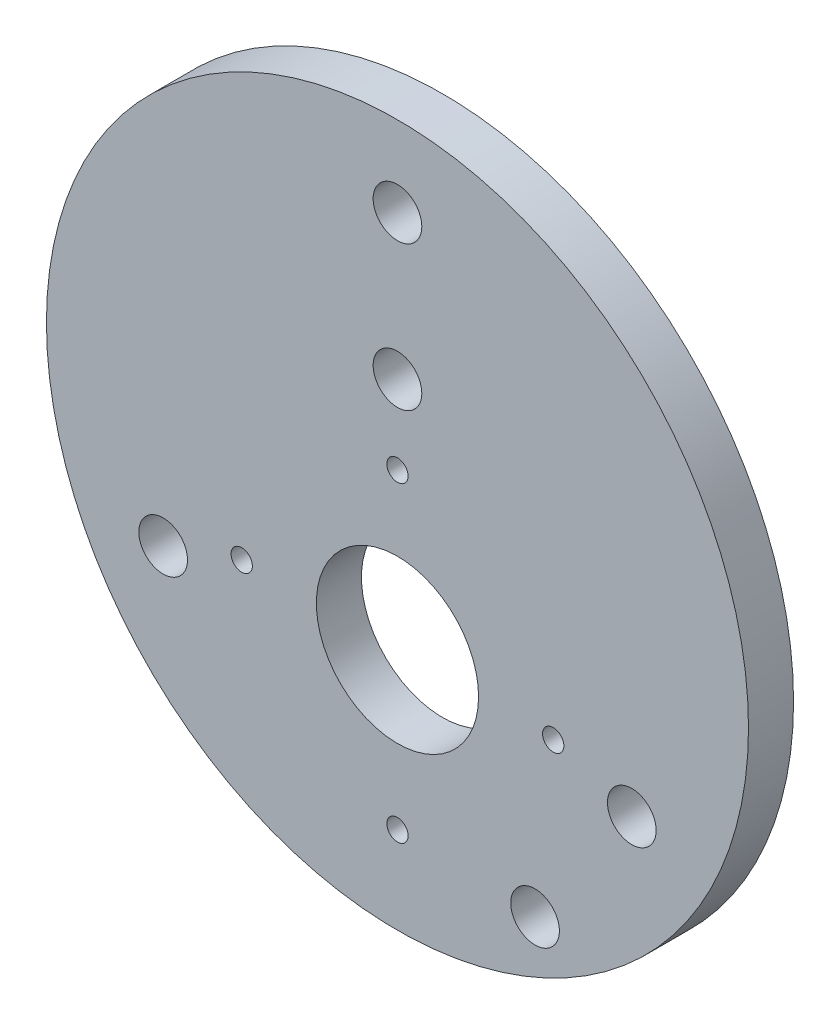
ISO-10303-21;
HEADER;
FILE_DESCRIPTION(('STEP AP214'),'2;1');
FILE_NAME('part.step','',(''),(''),'','','');
FILE_SCHEMA(('AUTOMOTIVE_DESIGN { 1 0 10303 214 1 1 1 1 }'));
ENDSEC;
DATA;
#1=APPLICATION_CONTEXT('core data for automotive mechanical design processes');
#2=APPLICATION_PROTOCOL_DEFINITION('international standard','automotive_design',2000,#1);
#3=PRODUCT_CONTEXT('',#1,'mechanical');
#4=PRODUCT('Part','Part','',(#3));
#5=PRODUCT_RELATED_PRODUCT_CATEGORY('part','',(#4));
#6=PRODUCT_DEFINITION_FORMATION('','',#4);
#7=PRODUCT_DEFINITION_CONTEXT('part definition',#1,'design');
#8=PRODUCT_DEFINITION('design','',#6,#7);
#9=PRODUCT_DEFINITION_SHAPE('','',#8);
#10=(LENGTH_UNIT() NAMED_UNIT(*) SI_UNIT(.MILLI.,.METRE.));
#11=(NAMED_UNIT(*) PLANE_ANGLE_UNIT() SI_UNIT($,.RADIAN.));
#12=(NAMED_UNIT(*) SI_UNIT($,.STERADIAN.) SOLID_ANGLE_UNIT());
#13=UNCERTAINTY_MEASURE_WITH_UNIT(LENGTH_MEASURE(1.E-05),#10,'distance_accuracy_value','');
#14=(GEOMETRIC_REPRESENTATION_CONTEXT(3) GLOBAL_UNCERTAINTY_ASSIGNED_CONTEXT((#13)) GLOBAL_UNIT_ASSIGNED_CONTEXT((#10,
#11,#12)) REPRESENTATION_CONTEXT('',''));
#15=CARTESIAN_POINT('',(0.,0.,0.));
#16=DIRECTION('',(0.,0.,1.));
#17=DIRECTION('',(1.,0.,0.));
#18=AXIS2_PLACEMENT_3D('',#15,#16,#17);
#19=CARTESIAN_POINT('',(0.,0.,6.35));
#20=DIRECTION('',(0.,0.,-1.));
#21=DIRECTION('',(-1.,0.,0.));
#22=AXIS2_PLACEMENT_3D('',#19,#20,#21);
#23=CYLINDRICAL_SURFACE('',#22,49.4665);
#24=CARTESIAN_POINT('',(0.,0.,6.35));
#25=DIRECTION('',(0.,0.,1.));
#26=DIRECTION('',(1.,0.,0.));
#27=AXIS2_PLACEMENT_3D('',#24,#25,#26);
#28=CIRCLE('',#27,49.4665);
#29=CARTESIAN_POINT('',(49.4665,0.,6.35));
#30=VERTEX_POINT('',#29);
#31=EDGE_CURVE('E10',#30,#30,#28,.T.);
#32=ORIENTED_EDGE('',*,*,#31,.F.);
#33=EDGE_LOOP('',(#32));
#34=FACE_BOUND('',#33,.T.);
#35=CARTESIAN_POINT('',(0.,0.,0.));
#36=DIRECTION('',(0.,0.,1.));
#37=DIRECTION('',(1.,0.,0.));
#38=AXIS2_PLACEMENT_3D('',#35,#36,#37);
#39=CIRCLE('',#38,49.4665);
#40=CARTESIAN_POINT('',(49.4665,0.,0.));
#41=VERTEX_POINT('',#40);
#42=EDGE_CURVE('E41',#41,#41,#39,.T.);
#43=ORIENTED_EDGE('',*,*,#42,.T.);
#44=EDGE_LOOP('',(#43));
#45=FACE_BOUND('',#44,.T.);
#46=ADVANCED_FACE('F38',(#34,#45),#23,.T.);
#47=CARTESIAN_POINT('',(0.,0.,6.35));
#48=DIRECTION('',(0.,0.,1.));
#49=DIRECTION('',(1.,0.,0.));
#50=AXIS2_PLACEMENT_3D('',#47,#48,#49);
#51=PLANE('',#50);
#52=CARTESIAN_POINT('',(19.3897127595552,-38.1355449146473,6.35));
#53=DIRECTION('',(0.,0.,1.));
#54=DIRECTION('',(1.,0.,0.));
#55=AXIS2_PLACEMENT_3D('',#52,#53,#54);
#56=CIRCLE('',#55,3.429);
#57=CARTESIAN_POINT('',(22.8187127595552,-38.1355449146473,6.35));
#58=VERTEX_POINT('',#57);
#59=EDGE_CURVE('E124',#58,#58,#56,.T.);
#60=ORIENTED_EDGE('',*,*,#59,.F.);
#61=EDGE_LOOP('',(#60));
#62=FACE_BOUND('',#61,.T.);
#63=CARTESIAN_POINT('',(0.,17.78,6.35));
#64=DIRECTION('',(0.,0.,1.));
#65=DIRECTION('',(1.,0.,0.));
#66=AXIS2_PLACEMENT_3D('',#63,#64,#65);
#67=CIRCLE('',#66,3.429);
#68=CARTESIAN_POINT('',(3.429,17.78,6.35));
#69=VERTEX_POINT('',#68);
#70=EDGE_CURVE('E116',#69,#69,#67,.T.);
#71=ORIENTED_EDGE('',*,*,#70,.F.);
#72=EDGE_LOOP('',(#71));
#73=FACE_BOUND('',#72,.T.);
#74=CARTESIAN_POINT('',(0.,-15.24,6.35));
#75=DIRECTION('',(0.,0.,1.));
#76=DIRECTION('',(1.,0.,0.));
#77=AXIS2_PLACEMENT_3D('',#74,#75,#76);
#78=CIRCLE('',#77,11.43);
#79=CARTESIAN_POINT('',(11.43,-15.24,6.35));
#80=VERTEX_POINT('',#79);
#81=EDGE_CURVE('E108',#80,#80,#78,.T.);
#82=ORIENTED_EDGE('',*,*,#81,.F.);
#83=EDGE_LOOP('',(#82));
#84=FACE_BOUND('',#83,.T.);
#85=CARTESIAN_POINT('',(0.,38.128211777283,6.35));
#86=DIRECTION('',(0.,0.,1.));
#87=DIRECTION('',(1.,0.,0.));
#88=AXIS2_PLACEMENT_3D('',#85,#86,#87);
#89=CIRCLE('',#88,3.429);
#90=CARTESIAN_POINT('',(3.429,38.128211777283,6.35));
#91=VERTEX_POINT('',#90);
#92=EDGE_CURVE('E101',#91,#91,#89,.T.);
#93=ORIENTED_EDGE('',*,*,#92,.F.);
#94=EDGE_LOOP('',(#93));
#95=FACE_BOUND('',#94,.T.);
#96=CARTESIAN_POINT('',(-33.0200000000003,-19.0641058886412,6.35));
#97=DIRECTION('',(0.,0.,1.));
#98=DIRECTION('',(1.,0.,0.));
#99=AXIS2_PLACEMENT_3D('',#96,#97,#98);
#100=CIRCLE('',#99,3.429);
#101=CARTESIAN_POINT('',(-29.5910000000003,-19.0641058886412,6.35));
#102=VERTEX_POINT('',#101);
#103=EDGE_CURVE('E93',#102,#102,#100,.T.);
#104=ORIENTED_EDGE('',*,*,#103,.F.);
#105=EDGE_LOOP('',(#104));
#106=FACE_BOUND('',#105,.T.);
#107=CARTESIAN_POINT('',(33.0200000000003,-19.0641058886412,6.35));
#108=DIRECTION('',(0.,0.,1.));
#109=DIRECTION('',(1.,0.,0.));
#110=AXIS2_PLACEMENT_3D('',#107,#108,#109);
#111=CIRCLE('',#110,3.429);
#112=CARTESIAN_POINT('',(36.4490000000003,-19.0641058886412,6.35));
#113=VERTEX_POINT('',#112);
#114=EDGE_CURVE('E84',#113,#113,#111,.T.);
#115=ORIENTED_EDGE('',*,*,#114,.F.);
#116=EDGE_LOOP('',(#115));
#117=FACE_BOUND('',#116,.T.);
#118=CARTESIAN_POINT('',(0.,6.70774595989301,6.35));
#119=DIRECTION('',(0.,0.,1.));
#120=DIRECTION('',(1.,0.,0.));
#121=AXIS2_PLACEMENT_3D('',#118,#119,#120);
#122=CIRCLE('',#121,1.5);
#123=CARTESIAN_POINT('',(1.49999999999991,6.70774595989301,6.35));
#124=VERTEX_POINT('',#123);
#125=EDGE_CURVE('E79',#124,#124,#122,.T.);
#126=ORIENTED_EDGE('',*,*,#125,.F.);
#127=EDGE_LOOP('',(#126));
#128=FACE_BOUND('',#127,.T.);
#129=CARTESIAN_POINT('',(-21.947745959893,-15.2400000000001,6.35));
#130=DIRECTION('',(0.,0.,1.));
#131=DIRECTION('',(1.,0.,0.));
#132=AXIS2_PLACEMENT_3D('',#129,#130,#131);
#133=CIRCLE('',#132,1.5);
#134=CARTESIAN_POINT('',(-20.447745959893,-15.2400000000001,6.35));
#135=VERTEX_POINT('',#134);
#136=EDGE_CURVE('E71',#135,#135,#133,.T.);
#137=ORIENTED_EDGE('',*,*,#136,.F.);
#138=EDGE_LOOP('',(#137));
#139=FACE_BOUND('',#138,.T.);
#140=CARTESIAN_POINT('',(0.,-37.187745959893,6.35));
#141=DIRECTION('',(0.,0.,1.));
#142=DIRECTION('',(1.,0.,0.));
#143=AXIS2_PLACEMENT_3D('',#140,#141,#142);
#144=CIRCLE('',#143,1.5);
#145=CARTESIAN_POINT('',(1.50000000000008,-37.187745959893,6.35));
#146=VERTEX_POINT('',#145);
#147=EDGE_CURVE('E63',#146,#146,#144,.T.);
#148=ORIENTED_EDGE('',*,*,#147,.F.);
#149=EDGE_LOOP('',(#148));
#150=FACE_BOUND('',#149,.T.);
#151=CARTESIAN_POINT('',(21.947745959893,-15.2399999999999,6.35));
#152=DIRECTION('',(0.,0.,1.));
#153=DIRECTION('',(1.,0.,0.));
#154=AXIS2_PLACEMENT_3D('',#151,#152,#153);
#155=CIRCLE('',#154,1.5);
#156=CARTESIAN_POINT('',(23.447745959893,-15.2399999999999,6.35));
#157=VERTEX_POINT('',#156);
#158=EDGE_CURVE('E55',#157,#157,#155,.T.);
#159=ORIENTED_EDGE('',*,*,#158,.F.);
#160=EDGE_LOOP('',(#159));
#161=FACE_BOUND('',#160,.T.);
#162=ORIENTED_EDGE('',*,*,#31,.T.);
#163=EDGE_LOOP('',(#162));
#164=FACE_BOUND('',#163,.T.);
#165=ADVANCED_FACE('F142',(#62,#73,#84,#95,#106,#117,#128,#139,#150,#161,#164),#51,.T.);
#166=CARTESIAN_POINT('',(0.,0.,0.));
#167=DIRECTION('',(0.,0.,1.));
#168=DIRECTION('',(1.,0.,0.));
#169=AXIS2_PLACEMENT_3D('',#166,#167,#168);
#170=PLANE('',#169);
#171=CARTESIAN_POINT('',(19.3897127595552,-38.1355449146473,0.));
#172=DIRECTION('',(0.,0.,1.));
#173=DIRECTION('',(1.,0.,0.));
#174=AXIS2_PLACEMENT_3D('',#171,#172,#173);
#175=CIRCLE('',#174,3.429);
#176=CARTESIAN_POINT('',(22.8187127595552,-38.1355449146473,0.));
#177=VERTEX_POINT('',#176);
#178=EDGE_CURVE('E120',#177,#177,#175,.T.);
#179=ORIENTED_EDGE('',*,*,#178,.T.);
#180=EDGE_LOOP('',(#179));
#181=FACE_BOUND('',#180,.T.);
#182=CARTESIAN_POINT('',(0.,17.78,0.));
#183=DIRECTION('',(0.,0.,1.));
#184=DIRECTION('',(1.,0.,0.));
#185=AXIS2_PLACEMENT_3D('',#182,#183,#184);
#186=CIRCLE('',#185,3.429);
#187=CARTESIAN_POINT('',(3.429,17.78,0.));
#188=VERTEX_POINT('',#187);
#189=EDGE_CURVE('E112',#188,#188,#186,.T.);
#190=ORIENTED_EDGE('',*,*,#189,.T.);
#191=EDGE_LOOP('',(#190));
#192=FACE_BOUND('',#191,.T.);
#193=CARTESIAN_POINT('',(0.,-15.24,0.));
#194=DIRECTION('',(0.,0.,1.));
#195=DIRECTION('',(1.,0.,0.));
#196=AXIS2_PLACEMENT_3D('',#193,#194,#195);
#197=CIRCLE('',#196,11.43);
#198=CARTESIAN_POINT('',(11.43,-15.24,0.));
#199=VERTEX_POINT('',#198);
#200=EDGE_CURVE('E89',#199,#199,#197,.T.);
#201=ORIENTED_EDGE('',*,*,#200,.T.);
#202=EDGE_LOOP('',(#201));
#203=FACE_BOUND('',#202,.T.);
#204=CARTESIAN_POINT('',(0.,38.128211777283,0.));
#205=DIRECTION('',(0.,0.,1.));
#206=DIRECTION('',(1.,0.,0.));
#207=AXIS2_PLACEMENT_3D('',#204,#205,#206);
#208=CIRCLE('',#207,3.429);
#209=CARTESIAN_POINT('',(3.429,38.128211777283,0.));
#210=VERTEX_POINT('',#209);
#211=EDGE_CURVE('E83',#210,#210,#208,.T.);
#212=ORIENTED_EDGE('',*,*,#211,.T.);
#213=EDGE_LOOP('',(#212));
#214=FACE_BOUND('',#213,.T.);
#215=CARTESIAN_POINT('',(-33.0200000000003,-19.0641058886412,0.));
#216=DIRECTION('',(0.,0.,1.));
#217=DIRECTION('',(1.,0.,0.));
#218=AXIS2_PLACEMENT_3D('',#215,#216,#217);
#219=CIRCLE('',#218,3.429);
#220=CARTESIAN_POINT('',(-29.5910000000003,-19.0641058886412,0.));
#221=VERTEX_POINT('',#220);
#222=EDGE_CURVE('E97',#221,#221,#219,.T.);
#223=ORIENTED_EDGE('',*,*,#222,.T.);
#224=EDGE_LOOP('',(#223));
#225=FACE_BOUND('',#224,.T.);
#226=CARTESIAN_POINT('',(33.0200000000003,-19.0641058886412,0.));
#227=DIRECTION('',(0.,0.,1.));
#228=DIRECTION('',(1.,0.,0.));
#229=AXIS2_PLACEMENT_3D('',#226,#227,#228);
#230=CIRCLE('',#229,3.429);
#231=CARTESIAN_POINT('',(36.4490000000003,-19.0641058886412,0.));
#232=VERTEX_POINT('',#231);
#233=EDGE_CURVE('E88',#232,#232,#230,.T.);
#234=ORIENTED_EDGE('',*,*,#233,.T.);
#235=EDGE_LOOP('',(#234));
#236=FACE_BOUND('',#235,.T.);
#237=CARTESIAN_POINT('',(0.,6.70774595989301,0.));
#238=DIRECTION('',(0.,0.,1.));
#239=DIRECTION('',(1.,0.,0.));
#240=AXIS2_PLACEMENT_3D('',#237,#238,#239);
#241=CIRCLE('',#240,1.5);
#242=CARTESIAN_POINT('',(1.49999999999991,6.70774595989301,0.));
#243=VERTEX_POINT('',#242);
#244=EDGE_CURVE('E75',#243,#243,#241,.T.);
#245=ORIENTED_EDGE('',*,*,#244,.T.);
#246=EDGE_LOOP('',(#245));
#247=FACE_BOUND('',#246,.T.);
#248=CARTESIAN_POINT('',(-21.947745959893,-15.2400000000001,0.));
#249=DIRECTION('',(0.,0.,1.));
#250=DIRECTION('',(1.,0.,0.));
#251=AXIS2_PLACEMENT_3D('',#248,#249,#250);
#252=CIRCLE('',#251,1.5);
#253=CARTESIAN_POINT('',(-20.447745959893,-15.2400000000001,0.));
#254=VERTEX_POINT('',#253);
#255=EDGE_CURVE('E67',#254,#254,#252,.T.);
#256=ORIENTED_EDGE('',*,*,#255,.T.);
#257=EDGE_LOOP('',(#256));
#258=FACE_BOUND('',#257,.T.);
#259=CARTESIAN_POINT('',(0.,-37.187745959893,0.));
#260=DIRECTION('',(0.,0.,1.));
#261=DIRECTION('',(1.,0.,0.));
#262=AXIS2_PLACEMENT_3D('',#259,#260,#261);
#263=CIRCLE('',#262,1.5);
#264=CARTESIAN_POINT('',(1.50000000000008,-37.187745959893,0.));
#265=VERTEX_POINT('',#264);
#266=EDGE_CURVE('E59',#265,#265,#263,.T.);
#267=ORIENTED_EDGE('',*,*,#266,.T.);
#268=EDGE_LOOP('',(#267));
#269=FACE_BOUND('',#268,.T.);
#270=CARTESIAN_POINT('',(21.947745959893,-15.2399999999999,0.));
#271=DIRECTION('',(0.,0.,1.));
#272=DIRECTION('',(1.,0.,0.));
#273=AXIS2_PLACEMENT_3D('',#270,#271,#272);
#274=CIRCLE('',#273,1.5);
#275=CARTESIAN_POINT('',(23.447745959893,-15.2399999999999,0.));
#276=VERTEX_POINT('',#275);
#277=EDGE_CURVE('E50',#276,#276,#274,.T.);
#278=ORIENTED_EDGE('',*,*,#277,.T.);
#279=EDGE_LOOP('',(#278));
#280=FACE_BOUND('',#279,.T.);
#281=ORIENTED_EDGE('',*,*,#42,.F.);
#282=EDGE_LOOP('',(#281));
#283=FACE_BOUND('',#282,.T.);
#284=ADVANCED_FACE('F132',(#181,#192,#203,#214,#225,#236,#247,#258,#269,#280,#283),#170,.F.);
#285=CARTESIAN_POINT('',(21.947745959893,-15.2399999999999,6.35));
#286=DIRECTION('',(0.,0.,1.));
#287=DIRECTION('',(1.,0.,0.));
#288=AXIS2_PLACEMENT_3D('',#285,#286,#287);
#289=CYLINDRICAL_SURFACE('',#288,1.5);
#290=ORIENTED_EDGE('',*,*,#277,.F.);
#291=EDGE_LOOP('',(#290));
#292=FACE_BOUND('',#291,.T.);
#293=ORIENTED_EDGE('',*,*,#158,.T.);
#294=EDGE_LOOP('',(#293));
#295=FACE_BOUND('',#294,.T.);
#296=ADVANCED_FACE('F164',(#292,#295),#289,.F.);
#297=CARTESIAN_POINT('',(0.,-37.187745959893,6.35));
#298=DIRECTION('',(0.,0.,1.));
#299=DIRECTION('',(1.,0.,0.));
#300=AXIS2_PLACEMENT_3D('',#297,#298,#299);
#301=CYLINDRICAL_SURFACE('',#300,1.5);
#302=ORIENTED_EDGE('',*,*,#266,.F.);
#303=EDGE_LOOP('',(#302));
#304=FACE_BOUND('',#303,.T.);
#305=ORIENTED_EDGE('',*,*,#147,.T.);
#306=EDGE_LOOP('',(#305));
#307=FACE_BOUND('',#306,.T.);
#308=ADVANCED_FACE('F166',(#304,#307),#301,.F.);
#309=CARTESIAN_POINT('',(-21.947745959893,-15.2400000000001,6.35));
#310=DIRECTION('',(0.,0.,1.));
#311=DIRECTION('',(1.,0.,0.));
#312=AXIS2_PLACEMENT_3D('',#309,#310,#311);
#313=CYLINDRICAL_SURFACE('',#312,1.5);
#314=ORIENTED_EDGE('',*,*,#255,.F.);
#315=EDGE_LOOP('',(#314));
#316=FACE_BOUND('',#315,.T.);
#317=ORIENTED_EDGE('',*,*,#136,.T.);
#318=EDGE_LOOP('',(#317));
#319=FACE_BOUND('',#318,.T.);
#320=ADVANCED_FACE('F173',(#316,#319),#313,.F.);
#321=CARTESIAN_POINT('',(0.,6.70774595989301,6.35));
#322=DIRECTION('',(0.,0.,1.));
#323=DIRECTION('',(1.,0.,0.));
#324=AXIS2_PLACEMENT_3D('',#321,#322,#323);
#325=CYLINDRICAL_SURFACE('',#324,1.5);
#326=ORIENTED_EDGE('',*,*,#244,.F.);
#327=EDGE_LOOP('',(#326));
#328=FACE_BOUND('',#327,.T.);
#329=ORIENTED_EDGE('',*,*,#125,.T.);
#330=EDGE_LOOP('',(#329));
#331=FACE_BOUND('',#330,.T.);
#332=ADVANCED_FACE('F239',(#328,#331),#325,.F.);
#333=CARTESIAN_POINT('',(33.0200000000003,-19.0641058886412,0.));
#334=DIRECTION('',(0.,0.,1.));
#335=DIRECTION('',(1.,0.,0.));
#336=AXIS2_PLACEMENT_3D('',#333,#334,#335);
#337=CYLINDRICAL_SURFACE('',#336,3.429);
#338=ORIENTED_EDGE('',*,*,#233,.F.);
#339=EDGE_LOOP('',(#338));
#340=FACE_BOUND('',#339,.T.);
#341=ORIENTED_EDGE('',*,*,#114,.T.);
#342=EDGE_LOOP('',(#341));
#343=FACE_BOUND('',#342,.T.);
#344=ADVANCED_FACE('F231',(#340,#343),#337,.F.);
#345=CARTESIAN_POINT('',(-33.0200000000003,-19.0641058886412,0.));
#346=DIRECTION('',(0.,0.,1.));
#347=DIRECTION('',(1.,0.,0.));
#348=AXIS2_PLACEMENT_3D('',#345,#346,#347);
#349=CYLINDRICAL_SURFACE('',#348,3.429);
#350=ORIENTED_EDGE('',*,*,#222,.F.);
#351=EDGE_LOOP('',(#350));
#352=FACE_BOUND('',#351,.T.);
#353=ORIENTED_EDGE('',*,*,#103,.T.);
#354=EDGE_LOOP('',(#353));
#355=FACE_BOUND('',#354,.T.);
#356=ADVANCED_FACE('F223',(#352,#355),#349,.F.);
#357=CARTESIAN_POINT('',(0.,38.128211777283,0.));
#358=DIRECTION('',(0.,0.,1.));
#359=DIRECTION('',(1.,0.,0.));
#360=AXIS2_PLACEMENT_3D('',#357,#358,#359);
#361=CYLINDRICAL_SURFACE('',#360,3.429);
#362=ORIENTED_EDGE('',*,*,#211,.F.);
#363=EDGE_LOOP('',(#362));
#364=FACE_BOUND('',#363,.T.);
#365=ORIENTED_EDGE('',*,*,#92,.T.);
#366=EDGE_LOOP('',(#365));
#367=FACE_BOUND('',#366,.T.);
#368=ADVANCED_FACE('F215',(#364,#367),#361,.F.);
#369=CARTESIAN_POINT('',(0.,-15.24,0.));
#370=DIRECTION('',(0.,0.,1.));
#371=DIRECTION('',(1.,0.,0.));
#372=AXIS2_PLACEMENT_3D('',#369,#370,#371);
#373=CYLINDRICAL_SURFACE('',#372,11.43);
#374=ORIENTED_EDGE('',*,*,#200,.F.);
#375=EDGE_LOOP('',(#374));
#376=FACE_BOUND('',#375,.T.);
#377=ORIENTED_EDGE('',*,*,#81,.T.);
#378=EDGE_LOOP('',(#377));
#379=FACE_BOUND('',#378,.T.);
#380=ADVANCED_FACE('F208',(#376,#379),#373,.F.);
#381=CARTESIAN_POINT('',(0.,17.78,0.));
#382=DIRECTION('',(0.,0.,1.));
#383=DIRECTION('',(1.,0.,0.));
#384=AXIS2_PLACEMENT_3D('',#381,#382,#383);
#385=CYLINDRICAL_SURFACE('',#384,3.429);
#386=ORIENTED_EDGE('',*,*,#189,.F.);
#387=EDGE_LOOP('',(#386));
#388=FACE_BOUND('',#387,.T.);
#389=ORIENTED_EDGE('',*,*,#70,.T.);
#390=EDGE_LOOP('',(#389));
#391=FACE_BOUND('',#390,.T.);
#392=ADVANCED_FACE('F138',(#388,#391),#385,.F.);
#393=CARTESIAN_POINT('',(19.3897127595552,-38.1355449146473,0.));
#394=DIRECTION('',(0.,0.,1.));
#395=DIRECTION('',(1.,0.,0.));
#396=AXIS2_PLACEMENT_3D('',#393,#394,#395);
#397=CYLINDRICAL_SURFACE('',#396,3.429);
#398=ORIENTED_EDGE('',*,*,#178,.F.);
#399=EDGE_LOOP('',(#398));
#400=FACE_BOUND('',#399,.T.);
#401=ORIENTED_EDGE('',*,*,#59,.T.);
#402=EDGE_LOOP('',(#401));
#403=FACE_BOUND('',#402,.T.);
#404=ADVANCED_FACE('F135',(#400,#403),#397,.F.);
#405=CLOSED_SHELL('',(#46,#165,#284,#296,#308,#320,#332,#344,#356,#368,#380,#392,#404));
#406=MANIFOLD_SOLID_BREP('B2',#405);
#407=ADVANCED_BREP_SHAPE_REPRESENTATION('',(#18,#406),#14);
#408=SHAPE_DEFINITION_REPRESENTATION(#9,#407);
ENDSEC;
END-ISO-10303-21;
